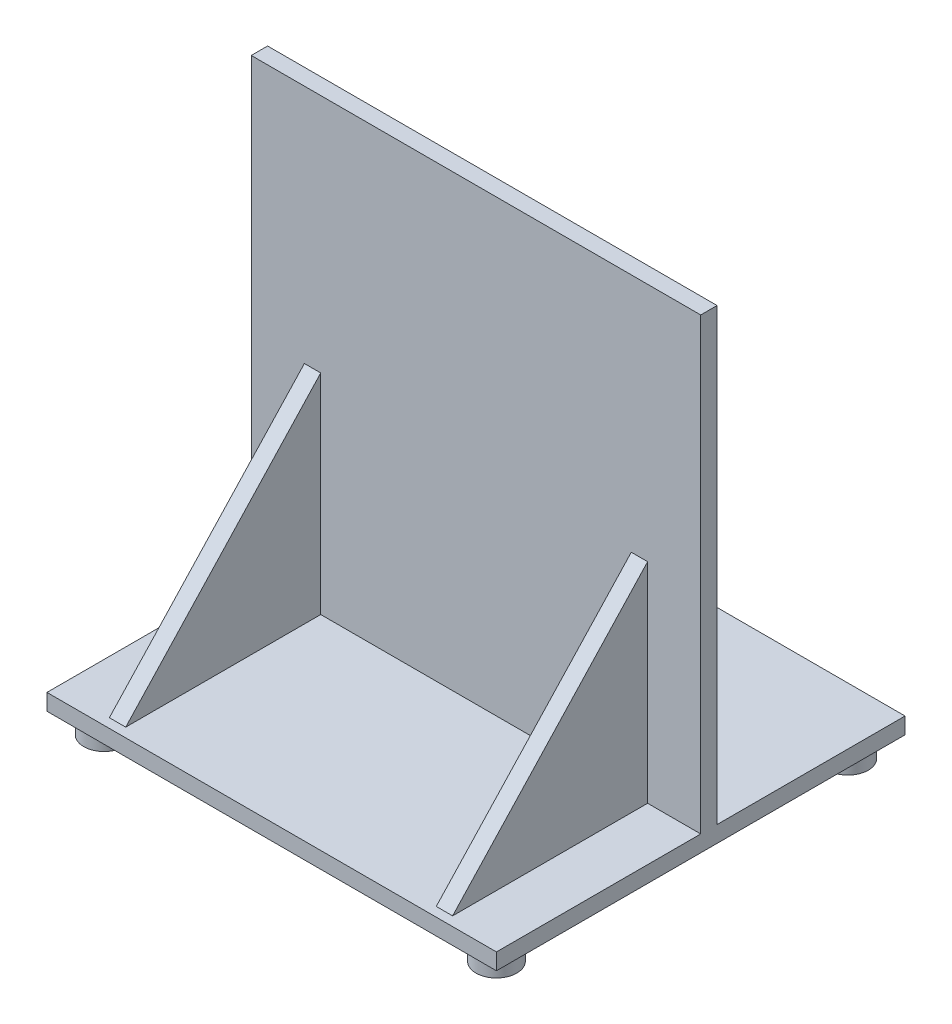
ISO-10303-21;
HEADER;
FILE_DESCRIPTION(('STEP AP214'),'2;1');
FILE_NAME('part.step','',(''),(''),'','','');
FILE_SCHEMA(('AUTOMOTIVE_DESIGN { 1 0 10303 214 1 1 1 1 }'));
ENDSEC;
DATA;
#1=APPLICATION_CONTEXT('core data for automotive mechanical design processes');
#2=APPLICATION_PROTOCOL_DEFINITION('international standard','automotive_design',2000,#1);
#3=PRODUCT_CONTEXT('',#1,'mechanical');
#4=PRODUCT('Part','Part','',(#3));
#5=PRODUCT_RELATED_PRODUCT_CATEGORY('part','',(#4));
#6=PRODUCT_DEFINITION_FORMATION('','',#4);
#7=PRODUCT_DEFINITION_CONTEXT('part definition',#1,'design');
#8=PRODUCT_DEFINITION('design','',#6,#7);
#9=PRODUCT_DEFINITION_SHAPE('','',#8);
#10=(LENGTH_UNIT() NAMED_UNIT(*) SI_UNIT(.MILLI.,.METRE.));
#11=(NAMED_UNIT(*) PLANE_ANGLE_UNIT() SI_UNIT($,.RADIAN.));
#12=(NAMED_UNIT(*) SI_UNIT($,.STERADIAN.) SOLID_ANGLE_UNIT());
#13=UNCERTAINTY_MEASURE_WITH_UNIT(LENGTH_MEASURE(1.E-05),#10,'distance_accuracy_value','');
#14=(GEOMETRIC_REPRESENTATION_CONTEXT(3) GLOBAL_UNCERTAINTY_ASSIGNED_CONTEXT((#13)) GLOBAL_UNIT_ASSIGNED_CONTEXT((#10,
#11,#12)) REPRESENTATION_CONTEXT('',''));
#15=CARTESIAN_POINT('',(0.,0.,0.));
#16=DIRECTION('',(0.,0.,1.));
#17=DIRECTION('',(1.,0.,0.));
#18=AXIS2_PLACEMENT_3D('',#15,#16,#17);
#19=CARTESIAN_POINT('',(0.,82.7884615384615,4.));
#20=DIRECTION('',(1.,0.,0.));
#21=DIRECTION('',(0.,1.,0.));
#22=AXIS2_PLACEMENT_3D('',#19,#20,#21);
#23=PLANE('',#22);
#24=DIRECTION('',(0.,-1.,0.));
#25=VECTOR('',#24,1.);
#26=CARTESIAN_POINT('',(0.,82.7884615384615,0.));
#27=LINE('',#26,#25);
#28=CARTESIAN_POINT('',(0.,82.7884615384615,0.));
#29=VERTEX_POINT('',#28);
#30=CARTESIAN_POINT('',(0.,-27.2115384615385,0.));
#31=VERTEX_POINT('',#30);
#32=EDGE_CURVE('E280',#29,#31,#27,.T.);
#33=ORIENTED_EDGE('',*,*,#32,.T.);
#34=DIRECTION('',(0.,0.,-1.));
#35=VECTOR('',#34,1.);
#36=CARTESIAN_POINT('',(0.,-27.2115384615385,-46.));
#37=LINE('',#36,#35);
#38=CARTESIAN_POINT('',(0.,-27.2115384615385,-46.));
#39=VERTEX_POINT('',#38);
#40=EDGE_CURVE('E240',#31,#39,#37,.T.);
#41=ORIENTED_EDGE('',*,*,#40,.T.);
#42=DIRECTION('',(0.,1.,0.));
#43=VECTOR('',#42,1.);
#44=CARTESIAN_POINT('',(0.,-31.2115384615385,-46.));
#45=LINE('',#44,#43);
#46=CARTESIAN_POINT('',(0.,-31.2115384615385,-46.));
#47=VERTEX_POINT('',#46);
#48=EDGE_CURVE('E277',#47,#39,#45,.T.);
#49=ORIENTED_EDGE('',*,*,#48,.F.);
#50=DIRECTION('',(0.,0.,-1.));
#51=VECTOR('',#50,1.);
#52=CARTESIAN_POINT('',(0.,-31.2115384615385,-46.));
#53=LINE('',#52,#51);
#54=CARTESIAN_POINT('',(0.,-31.2115384615385,54.));
#55=VERTEX_POINT('',#54);
#56=EDGE_CURVE('E248',#55,#47,#53,.T.);
#57=ORIENTED_EDGE('',*,*,#56,.F.);
#58=DIRECTION('',(0.,1.,0.));
#59=VECTOR('',#58,1.);
#60=CARTESIAN_POINT('',(0.,-31.2115384615385,54.));
#61=LINE('',#60,#59);
#62=CARTESIAN_POINT('',(0.,-27.2115384615385,54.));
#63=VERTEX_POINT('',#62);
#64=EDGE_CURVE('E258',#55,#63,#61,.T.);
#65=ORIENTED_EDGE('',*,*,#64,.T.);
#66=CARTESIAN_POINT('',(0.,-27.2115384615385,4.));
#67=VERTEX_POINT('',#66);
#68=EDGE_CURVE('E259',#63,#67,#37,.T.);
#69=ORIENTED_EDGE('',*,*,#68,.T.);
#70=DIRECTION('',(0.,-1.,0.));
#71=VECTOR('',#70,1.);
#72=CARTESIAN_POINT('',(0.,82.7884615384615,4.));
#73=LINE('',#72,#71);
#74=CARTESIAN_POINT('',(0.,82.7884615384615,4.));
#75=VERTEX_POINT('',#74);
#76=EDGE_CURVE('E281',#75,#67,#73,.T.);
#77=ORIENTED_EDGE('',*,*,#76,.F.);
#78=DIRECTION('',(0.,0.,-1.));
#79=VECTOR('',#78,1.);
#80=CARTESIAN_POINT('',(0.,82.7884615384615,4.));
#81=LINE('',#80,#79);
#82=EDGE_CURVE('E293',#75,#29,#81,.T.);
#83=ORIENTED_EDGE('',*,*,#82,.T.);
#84=EDGE_LOOP('',(#33,#41,#49,#57,#65,#69,#77,#83));
#85=FACE_BOUND('',#84,.T.);
#86=ADVANCED_FACE('F35',(#85),#23,.F.);
#87=CARTESIAN_POINT('',(110.,82.7884615384615,4.));
#88=DIRECTION('',(-1.,0.,0.));
#89=DIRECTION('',(0.,-1.,0.));
#90=AXIS2_PLACEMENT_3D('',#87,#88,#89);
#91=PLANE('',#90);
#92=DIRECTION('',(0.,1.,0.));
#93=VECTOR('',#92,1.);
#94=CARTESIAN_POINT('',(110.,82.7884615384615,0.));
#95=LINE('',#94,#93);
#96=CARTESIAN_POINT('',(110.,-27.2115384615385,0.));
#97=VERTEX_POINT('',#96);
#98=CARTESIAN_POINT('',(110.,82.7884615384615,0.));
#99=VERTEX_POINT('',#98);
#100=EDGE_CURVE('E298',#97,#99,#95,.T.);
#101=ORIENTED_EDGE('',*,*,#100,.T.);
#102=DIRECTION('',(0.,0.,-1.));
#103=VECTOR('',#102,1.);
#104=CARTESIAN_POINT('',(110.,82.7884615384615,4.));
#105=LINE('',#104,#103);
#106=CARTESIAN_POINT('',(110.,82.7884615384615,4.));
#107=VERTEX_POINT('',#106);
#108=EDGE_CURVE('E303',#107,#99,#105,.T.);
#109=ORIENTED_EDGE('',*,*,#108,.F.);
#110=DIRECTION('',(0.,1.,0.));
#111=VECTOR('',#110,1.);
#112=CARTESIAN_POINT('',(110.,82.7884615384615,4.));
#113=LINE('',#112,#111);
#114=CARTESIAN_POINT('',(110.,-27.2115384615385,4.));
#115=VERTEX_POINT('',#114);
#116=EDGE_CURVE('E289',#115,#107,#113,.T.);
#117=ORIENTED_EDGE('',*,*,#116,.F.);
#118=DIRECTION('',(0.,0.,1.));
#119=VECTOR('',#118,1.);
#120=CARTESIAN_POINT('',(110.,-27.2115384615385,-46.));
#121=LINE('',#120,#119);
#122=CARTESIAN_POINT('',(110.,-27.2115384615385,54.));
#123=VERTEX_POINT('',#122);
#124=EDGE_CURVE('E264',#115,#123,#121,.T.);
#125=ORIENTED_EDGE('',*,*,#124,.T.);
#126=DIRECTION('',(0.,1.,0.));
#127=VECTOR('',#126,1.);
#128=CARTESIAN_POINT('',(110.,-31.2115384615385,54.));
#129=LINE('',#128,#127);
#130=CARTESIAN_POINT('',(110.,-31.2115384615385,54.));
#131=VERTEX_POINT('',#130);
#132=EDGE_CURVE('E271',#131,#123,#129,.T.);
#133=ORIENTED_EDGE('',*,*,#132,.F.);
#134=DIRECTION('',(0.,0.,1.));
#135=VECTOR('',#134,1.);
#136=CARTESIAN_POINT('',(110.,-31.2115384615385,-46.));
#137=LINE('',#136,#135);
#138=CARTESIAN_POINT('',(110.,-31.2115384615385,-46.));
#139=VERTEX_POINT('',#138);
#140=EDGE_CURVE('E254',#139,#131,#137,.T.);
#141=ORIENTED_EDGE('',*,*,#140,.F.);
#142=DIRECTION('',(0.,1.,0.));
#143=VECTOR('',#142,1.);
#144=CARTESIAN_POINT('',(110.,-31.2115384615385,-46.));
#145=LINE('',#144,#143);
#146=CARTESIAN_POINT('',(110.,-27.2115384615385,-46.));
#147=VERTEX_POINT('',#146);
#148=EDGE_CURVE('E274',#139,#147,#145,.T.);
#149=ORIENTED_EDGE('',*,*,#148,.T.);
#150=EDGE_CURVE('E265',#147,#97,#121,.T.);
#151=ORIENTED_EDGE('',*,*,#150,.T.);
#152=EDGE_LOOP('',(#101,#109,#117,#125,#133,#141,#149,#151));
#153=FACE_BOUND('',#152,.T.);
#154=ADVANCED_FACE('F343',(#153),#91,.F.);
#155=CARTESIAN_POINT('',(0.,82.7884615384615,4.));
#156=DIRECTION('',(0.,-1.,0.));
#157=DIRECTION('',(1.,0.,0.));
#158=AXIS2_PLACEMENT_3D('',#155,#156,#157);
#159=PLANE('',#158);
#160=DIRECTION('',(-1.,0.,0.));
#161=VECTOR('',#160,1.);
#162=CARTESIAN_POINT('',(0.,82.7884615384615,0.));
#163=LINE('',#162,#161);
#164=EDGE_CURVE('E285',#99,#29,#163,.T.);
#165=ORIENTED_EDGE('',*,*,#164,.T.);
#166=ORIENTED_EDGE('',*,*,#82,.F.);
#167=DIRECTION('',(-1.,0.,0.));
#168=VECTOR('',#167,1.);
#169=CARTESIAN_POINT('',(0.,82.7884615384615,4.));
#170=LINE('',#169,#168);
#171=EDGE_CURVE('E291',#107,#75,#170,.T.);
#172=ORIENTED_EDGE('',*,*,#171,.F.);
#173=ORIENTED_EDGE('',*,*,#108,.T.);
#174=EDGE_LOOP('',(#165,#166,#172,#173));
#175=FACE_BOUND('',#174,.T.);
#176=ADVANCED_FACE('F348',(#175),#159,.F.);
#177=CARTESIAN_POINT('',(0.,0.,4.));
#178=DIRECTION('',(0.,0.,1.));
#179=DIRECTION('',(1.,0.,0.));
#180=AXIS2_PLACEMENT_3D('',#177,#178,#179);
#181=PLANE('',#180);
#182=DIRECTION('',(0.,1.,0.));
#183=VECTOR('',#182,1.);
#184=CARTESIAN_POINT('',(97.,0.,4.));
#185=LINE('',#184,#183);
#186=CARTESIAN_POINT('',(97.,-27.2115384615385,4.));
#187=VERTEX_POINT('',#186);
#188=CARTESIAN_POINT('',(97.,23.9961611794516,4.));
#189=VERTEX_POINT('',#188);
#190=EDGE_CURVE('E183',#187,#189,#185,.T.);
#191=ORIENTED_EDGE('',*,*,#190,.F.);
#192=DIRECTION('',(1.,0.,0.));
#193=VECTOR('',#192,1.);
#194=CARTESIAN_POINT('',(0.,-27.2115384615385,4.));
#195=LINE('',#194,#193);
#196=EDGE_CURVE('E284',#187,#115,#195,.T.);
#197=ORIENTED_EDGE('',*,*,#196,.T.);
#198=ORIENTED_EDGE('',*,*,#116,.T.);
#199=ORIENTED_EDGE('',*,*,#171,.T.);
#200=ORIENTED_EDGE('',*,*,#76,.T.);
#201=CARTESIAN_POINT('',(13.,-27.2115384615385,4.));
#202=VERTEX_POINT('',#201);
#203=EDGE_CURVE('E286',#67,#202,#195,.T.);
#204=ORIENTED_EDGE('',*,*,#203,.T.);
#205=DIRECTION('',(0.,1.,0.));
#206=VECTOR('',#205,1.);
#207=CARTESIAN_POINT('',(13.,0.,4.));
#208=LINE('',#207,#206);
#209=CARTESIAN_POINT('',(13.,23.9961611794516,4.00000000000001));
#210=VERTEX_POINT('',#209);
#211=EDGE_CURVE('E57',#202,#210,#208,.T.);
#212=ORIENTED_EDGE('',*,*,#211,.T.);
#213=DIRECTION('',(1.,0.,0.));
#214=VECTOR('',#213,1.);
#215=CARTESIAN_POINT('',(0.,23.9961611794516,4.));
#216=LINE('',#215,#214);
#217=CARTESIAN_POINT('',(17.,23.9961611794516,4.00000000000001));
#218=VERTEX_POINT('',#217);
#219=EDGE_CURVE('E202',#218,#210,#216,.F.);
#220=ORIENTED_EDGE('',*,*,#219,.F.);
#221=DIRECTION('',(0.,1.,0.));
#222=VECTOR('',#221,1.);
#223=CARTESIAN_POINT('',(17.,0.,4.));
#224=LINE('',#223,#222);
#225=CARTESIAN_POINT('',(17.,-27.2115384615385,4.));
#226=VERTEX_POINT('',#225);
#227=EDGE_CURVE('E198',#226,#218,#224,.T.);
#228=ORIENTED_EDGE('',*,*,#227,.F.);
#229=CARTESIAN_POINT('',(93.,-27.2115384615385,4.));
#230=VERTEX_POINT('',#229);
#231=EDGE_CURVE('E180',#226,#230,#195,.T.);
#232=ORIENTED_EDGE('',*,*,#231,.T.);
#233=DIRECTION('',(0.,1.,0.));
#234=VECTOR('',#233,1.);
#235=CARTESIAN_POINT('',(93.,0.,4.));
#236=LINE('',#235,#234);
#237=CARTESIAN_POINT('',(93.,23.9961611794516,4.));
#238=VERTEX_POINT('',#237);
#239=EDGE_CURVE('E49',#230,#238,#236,.T.);
#240=ORIENTED_EDGE('',*,*,#239,.T.);
#241=DIRECTION('',(-1.,0.,0.));
#242=VECTOR('',#241,1.);
#243=CARTESIAN_POINT('',(0.,23.9961611794516,4.));
#244=LINE('',#243,#242);
#245=EDGE_CURVE('E162',#189,#238,#244,.T.);
#246=ORIENTED_EDGE('',*,*,#245,.F.);
#247=EDGE_LOOP('',(#191,#197,#198,#199,#200,#204,#212,#220,#228,#232,#240,#246));
#248=FACE_BOUND('',#247,.T.);
#249=ADVANCED_FACE('F177',(#248),#181,.T.);
#250=CARTESIAN_POINT('',(0.,0.,0.));
#251=DIRECTION('',(0.,0.,1.));
#252=DIRECTION('',(1.,0.,0.));
#253=AXIS2_PLACEMENT_3D('',#250,#251,#252);
#254=PLANE('',#253);
#255=DIRECTION('',(0.,1.,0.));
#256=VECTOR('',#255,1.);
#257=CARTESIAN_POINT('',(4.99999999999999,77.7884615384615,0.));
#258=LINE('',#257,#256);
#259=CARTESIAN_POINT('',(4.99999999999998,-22.2115384615385,0.));
#260=VERTEX_POINT('',#259);
#261=CARTESIAN_POINT('',(4.99999999999999,77.7884615384615,0.));
#262=VERTEX_POINT('',#261);
#263=EDGE_CURVE('E233',#260,#262,#258,.T.);
#264=ORIENTED_EDGE('',*,*,#263,.F.);
#265=DIRECTION('',(-1.,0.,0.));
#266=VECTOR('',#265,1.);
#267=CARTESIAN_POINT('',(105.,-22.2115384615385,0.));
#268=LINE('',#267,#266);
#269=CARTESIAN_POINT('',(105.,-22.2115384615385,0.));
#270=VERTEX_POINT('',#269);
#271=EDGE_CURVE('E231',#270,#260,#268,.T.);
#272=ORIENTED_EDGE('',*,*,#271,.F.);
#273=DIRECTION('',(0.,-1.,0.));
#274=VECTOR('',#273,1.);
#275=CARTESIAN_POINT('',(105.,77.7884615384615,0.));
#276=LINE('',#275,#274);
#277=CARTESIAN_POINT('',(105.,77.7884615384615,0.));
#278=VERTEX_POINT('',#277);
#279=EDGE_CURVE('E216',#278,#270,#276,.T.);
#280=ORIENTED_EDGE('',*,*,#279,.F.);
#281=DIRECTION('',(1.,0.,0.));
#282=VECTOR('',#281,1.);
#283=CARTESIAN_POINT('',(105.,77.7884615384615,0.));
#284=LINE('',#283,#282);
#285=EDGE_CURVE('E221',#262,#278,#284,.T.);
#286=ORIENTED_EDGE('',*,*,#285,.F.);
#287=EDGE_LOOP('',(#264,#272,#280,#286));
#288=FACE_BOUND('',#287,.T.);
#289=ORIENTED_EDGE('',*,*,#100,.F.);
#290=DIRECTION('',(1.,0.,0.));
#291=VECTOR('',#290,1.);
#292=CARTESIAN_POINT('',(0.,-27.2115384615385,0.));
#293=LINE('',#292,#291);
#294=EDGE_CURVE('E296',#31,#97,#293,.T.);
#295=ORIENTED_EDGE('',*,*,#294,.F.);
#296=ORIENTED_EDGE('',*,*,#32,.F.);
#297=ORIENTED_EDGE('',*,*,#164,.F.);
#298=EDGE_LOOP('',(#289,#295,#296,#297));
#299=FACE_BOUND('',#298,.T.);
#300=ADVANCED_FACE('F359',(#288,#299),#254,.F.);
#301=CARTESIAN_POINT('',(0.,-27.2115384615385,0.));
#302=DIRECTION('',(0.,1.,0.));
#303=DIRECTION('',(0.,0.,1.));
#304=AXIS2_PLACEMENT_3D('',#301,#302,#303);
#305=PLANE('',#304);
#306=DIRECTION('',(0.,0.,-1.));
#307=VECTOR('',#306,1.);
#308=CARTESIAN_POINT('',(97.,-27.2115384615385,0.));
#309=LINE('',#308,#307);
#310=CARTESIAN_POINT('',(97.,-27.2115384615385,51.7260044156029));
#311=VERTEX_POINT('',#310);
#312=EDGE_CURVE('E181',#311,#187,#309,.T.);
#313=ORIENTED_EDGE('',*,*,#312,.F.);
#314=DIRECTION('',(1.,0.,0.));
#315=VECTOR('',#314,1.);
#316=CARTESIAN_POINT('',(0.,-27.2115384615385,51.7260044156029));
#317=LINE('',#316,#315);
#318=CARTESIAN_POINT('',(93.,-27.2115384615385,51.7260044156029));
#319=VERTEX_POINT('',#318);
#320=EDGE_CURVE('E171',#319,#311,#317,.T.);
#321=ORIENTED_EDGE('',*,*,#320,.F.);
#322=DIRECTION('',(0.,0.,-1.));
#323=VECTOR('',#322,1.);
#324=CARTESIAN_POINT('',(93.,-27.2115384615385,0.));
#325=LINE('',#324,#323);
#326=EDGE_CURVE('E174',#319,#230,#325,.T.);
#327=ORIENTED_EDGE('',*,*,#326,.T.);
#328=ORIENTED_EDGE('',*,*,#231,.F.);
#329=DIRECTION('',(0.,0.,-1.));
#330=VECTOR('',#329,1.);
#331=CARTESIAN_POINT('',(17.,-27.2115384615385,0.));
#332=LINE('',#331,#330);
#333=CARTESIAN_POINT('',(17.,-27.2115384615385,51.7260044156029));
#334=VERTEX_POINT('',#333);
#335=EDGE_CURVE('E196',#334,#226,#332,.T.);
#336=ORIENTED_EDGE('',*,*,#335,.F.);
#337=DIRECTION('',(-1.,0.,0.));
#338=VECTOR('',#337,1.);
#339=CARTESIAN_POINT('',(0.,-27.2115384615385,51.7260044156029));
#340=LINE('',#339,#338);
#341=CARTESIAN_POINT('',(13.,-27.2115384615385,51.7260044156029));
#342=VERTEX_POINT('',#341);
#343=EDGE_CURVE('E200',#342,#334,#340,.F.);
#344=ORIENTED_EDGE('',*,*,#343,.F.);
#345=DIRECTION('',(0.,0.,-1.));
#346=VECTOR('',#345,1.);
#347=CARTESIAN_POINT('',(13.,-27.2115384615385,0.));
#348=LINE('',#347,#346);
#349=EDGE_CURVE('E192',#342,#202,#348,.T.);
#350=ORIENTED_EDGE('',*,*,#349,.T.);
#351=ORIENTED_EDGE('',*,*,#203,.F.);
#352=ORIENTED_EDGE('',*,*,#68,.F.);
#353=DIRECTION('',(-1.,0.,0.));
#354=VECTOR('',#353,1.);
#355=CARTESIAN_POINT('',(0.,-27.2115384615385,54.));
#356=LINE('',#355,#354);
#357=EDGE_CURVE('E252',#123,#63,#356,.T.);
#358=ORIENTED_EDGE('',*,*,#357,.F.);
#359=ORIENTED_EDGE('',*,*,#124,.F.);
#360=ORIENTED_EDGE('',*,*,#196,.F.);
#361=EDGE_LOOP('',(#313,#321,#327,#328,#336,#344,#350,#351,#352,#358,#359,#360));
#362=FACE_BOUND('',#361,.T.);
#363=ADVANCED_FACE('F378',(#362),#305,.T.);
#364=CARTESIAN_POINT('',(0.,-31.2115384615385,-46.));
#365=DIRECTION('',(0.,0.,1.));
#366=DIRECTION('',(1.,0.,0.));
#367=AXIS2_PLACEMENT_3D('',#364,#365,#366);
#368=PLANE('',#367);
#369=ORIENTED_EDGE('',*,*,#148,.F.);
#370=DIRECTION('',(1.,0.,0.));
#371=VECTOR('',#370,1.);
#372=CARTESIAN_POINT('',(0.,-31.2115384615385,-46.));
#373=LINE('',#372,#371);
#374=EDGE_CURVE('E251',#47,#139,#373,.T.);
#375=ORIENTED_EDGE('',*,*,#374,.F.);
#376=ORIENTED_EDGE('',*,*,#48,.T.);
#377=DIRECTION('',(1.,0.,0.));
#378=VECTOR('',#377,1.);
#379=CARTESIAN_POINT('',(0.,-27.2115384615385,-46.));
#380=LINE('',#379,#378);
#381=EDGE_CURVE('E262',#39,#147,#380,.T.);
#382=ORIENTED_EDGE('',*,*,#381,.T.);
#383=EDGE_LOOP('',(#369,#375,#376,#382));
#384=FACE_BOUND('',#383,.T.);
#385=ADVANCED_FACE('F367',(#384),#368,.F.);
#386=CARTESIAN_POINT('',(0.,-31.2115384615385,54.));
#387=DIRECTION('',(0.,0.,-1.));
#388=DIRECTION('',(-1.,0.,0.));
#389=AXIS2_PLACEMENT_3D('',#386,#387,#388);
#390=PLANE('',#389);
#391=ORIENTED_EDGE('',*,*,#64,.F.);
#392=DIRECTION('',(-1.,0.,0.));
#393=VECTOR('',#392,1.);
#394=CARTESIAN_POINT('',(0.,-31.2115384615385,54.));
#395=LINE('',#394,#393);
#396=EDGE_CURVE('E256',#131,#55,#395,.T.);
#397=ORIENTED_EDGE('',*,*,#396,.F.);
#398=ORIENTED_EDGE('',*,*,#132,.T.);
#399=ORIENTED_EDGE('',*,*,#357,.T.);
#400=EDGE_LOOP('',(#391,#397,#398,#399));
#401=FACE_BOUND('',#400,.T.);
#402=ADVANCED_FACE('F320',(#401),#390,.F.);
#403=CARTESIAN_POINT('',(0.,-31.2115384615385,0.));
#404=DIRECTION('',(0.,1.,0.));
#405=DIRECTION('',(0.,0.,1.));
#406=AXIS2_PLACEMENT_3D('',#403,#404,#405);
#407=PLANE('',#406);
#408=CARTESIAN_POINT('',(103.,-31.2115384615385,-39.));
#409=DIRECTION('',(0.,1.,0.));
#410=DIRECTION('',(0.,0.,1.));
#411=AXIS2_PLACEMENT_3D('',#408,#409,#410);
#412=CIRCLE('',#411,5.00000000000001);
#413=CARTESIAN_POINT('',(103.,-31.2115384615385,-34.));
#414=VERTEX_POINT('',#413);
#415=EDGE_CURVE('E11',#414,#414,#412,.F.);
#416=ORIENTED_EDGE('',*,*,#415,.F.);
#417=EDGE_LOOP('',(#416));
#418=FACE_BOUND('',#417,.T.);
#419=CARTESIAN_POINT('',(103.,-31.2115384615385,47.));
#420=DIRECTION('',(0.,1.,0.));
#421=DIRECTION('',(0.,0.,1.));
#422=AXIS2_PLACEMENT_3D('',#419,#420,#421);
#423=CIRCLE('',#422,5.00000000000001);
#424=CARTESIAN_POINT('',(103.,-31.2115384615385,52.));
#425=VERTEX_POINT('',#424);
#426=EDGE_CURVE('E309',#425,#425,#423,.F.);
#427=ORIENTED_EDGE('',*,*,#426,.F.);
#428=EDGE_LOOP('',(#427));
#429=FACE_BOUND('',#428,.T.);
#430=ORIENTED_EDGE('',*,*,#396,.T.);
#431=ORIENTED_EDGE('',*,*,#56,.T.);
#432=ORIENTED_EDGE('',*,*,#374,.T.);
#433=ORIENTED_EDGE('',*,*,#140,.T.);
#434=EDGE_LOOP('',(#430,#431,#432,#433));
#435=FACE_BOUND('',#434,.T.);
#436=CARTESIAN_POINT('',(7.00000000000001,-31.2115384615385,-39.));
#437=DIRECTION('',(0.,1.,0.));
#438=DIRECTION('',(0.,0.,1.));
#439=AXIS2_PLACEMENT_3D('',#436,#437,#438);
#440=CIRCLE('',#439,5.);
#441=CARTESIAN_POINT('',(7.00000000000001,-31.2115384615385,-34.));
#442=VERTEX_POINT('',#441);
#443=EDGE_CURVE('E42',#442,#442,#440,.F.);
#444=ORIENTED_EDGE('',*,*,#443,.F.);
#445=EDGE_LOOP('',(#444));
#446=FACE_BOUND('',#445,.T.);
#447=CARTESIAN_POINT('',(7.00000000000001,-31.2115384615385,47.));
#448=DIRECTION('',(0.,1.,0.));
#449=DIRECTION('',(0.,0.,1.));
#450=AXIS2_PLACEMENT_3D('',#447,#448,#449);
#451=CIRCLE('',#450,5.);
#452=CARTESIAN_POINT('',(7.00000000000001,-31.2115384615385,52.));
#453=VERTEX_POINT('',#452);
#454=EDGE_CURVE('E306',#453,#453,#451,.F.);
#455=ORIENTED_EDGE('',*,*,#454,.F.);
#456=EDGE_LOOP('',(#455));
#457=FACE_BOUND('',#456,.T.);
#458=ADVANCED_FACE('F316',(#418,#429,#435,#446,#457),#407,.F.);
#459=ORIENTED_EDGE('',*,*,#150,.F.);
#460=ORIENTED_EDGE('',*,*,#381,.F.);
#461=ORIENTED_EDGE('',*,*,#40,.F.);
#462=ORIENTED_EDGE('',*,*,#294,.T.);
#463=EDGE_LOOP('',(#459,#460,#461,#462));
#464=FACE_BOUND('',#463,.T.);
#465=ADVANCED_FACE('F319',(#464),#305,.T.);
#466=CARTESIAN_POINT('',(105.,77.7884615384615,1.));
#467=DIRECTION('',(1.,0.,0.));
#468=DIRECTION('',(0.,1.,0.));
#469=AXIS2_PLACEMENT_3D('',#466,#467,#468);
#470=PLANE('',#469);
#471=ORIENTED_EDGE('',*,*,#279,.T.);
#472=DIRECTION('',(0.,0.,-1.));
#473=VECTOR('',#472,1.);
#474=CARTESIAN_POINT('',(105.,-22.2115384615385,1.));
#475=LINE('',#474,#473);
#476=CARTESIAN_POINT('',(105.,-22.2115384615385,1.));
#477=VERTEX_POINT('',#476);
#478=EDGE_CURVE('E229',#477,#270,#475,.T.);
#479=ORIENTED_EDGE('',*,*,#478,.F.);
#480=DIRECTION('',(0.,-1.,0.));
#481=VECTOR('',#480,1.);
#482=CARTESIAN_POINT('',(105.,77.7884615384615,1.));
#483=LINE('',#482,#481);
#484=CARTESIAN_POINT('',(105.,77.7884615384615,1.));
#485=VERTEX_POINT('',#484);
#486=EDGE_CURVE('E217',#485,#477,#483,.T.);
#487=ORIENTED_EDGE('',*,*,#486,.F.);
#488=DIRECTION('',(0.,0.,-1.));
#489=VECTOR('',#488,1.);
#490=CARTESIAN_POINT('',(105.,77.7884615384615,1.));
#491=LINE('',#490,#489);
#492=EDGE_CURVE('E238',#485,#278,#491,.T.);
#493=ORIENTED_EDGE('',*,*,#492,.T.);
#494=EDGE_LOOP('',(#471,#479,#487,#493));
#495=FACE_BOUND('',#494,.T.);
#496=ADVANCED_FACE('F398',(#495),#470,.F.);
#497=CARTESIAN_POINT('',(105.,77.7884615384615,1.));
#498=DIRECTION('',(0.,1.,0.));
#499=DIRECTION('',(0.,0.,1.));
#500=AXIS2_PLACEMENT_3D('',#497,#498,#499);
#501=PLANE('',#500);
#502=ORIENTED_EDGE('',*,*,#285,.T.);
#503=ORIENTED_EDGE('',*,*,#492,.F.);
#504=DIRECTION('',(1.,0.,0.));
#505=VECTOR('',#504,1.);
#506=CARTESIAN_POINT('',(105.,77.7884615384615,1.));
#507=LINE('',#506,#505);
#508=CARTESIAN_POINT('',(4.99999999999999,77.7884615384615,1.));
#509=VERTEX_POINT('',#508);
#510=EDGE_CURVE('E226',#509,#485,#507,.T.);
#511=ORIENTED_EDGE('',*,*,#510,.F.);
#512=DIRECTION('',(0.,0.,-1.));
#513=VECTOR('',#512,1.);
#514=CARTESIAN_POINT('',(4.99999999999999,77.7884615384615,1.));
#515=LINE('',#514,#513);
#516=EDGE_CURVE('E241',#509,#262,#515,.T.);
#517=ORIENTED_EDGE('',*,*,#516,.T.);
#518=EDGE_LOOP('',(#502,#503,#511,#517));
#519=FACE_BOUND('',#518,.T.);
#520=ADVANCED_FACE('F402',(#519),#501,.F.);
#521=CARTESIAN_POINT('',(4.99999999999999,77.7884615384615,1.));
#522=DIRECTION('',(-1.,0.,0.));
#523=DIRECTION('',(0.,-1.,0.));
#524=AXIS2_PLACEMENT_3D('',#521,#522,#523);
#525=PLANE('',#524);
#526=ORIENTED_EDGE('',*,*,#263,.T.);
#527=ORIENTED_EDGE('',*,*,#516,.F.);
#528=DIRECTION('',(0.,1.,0.));
#529=VECTOR('',#528,1.);
#530=CARTESIAN_POINT('',(4.99999999999999,77.7884615384615,1.));
#531=LINE('',#530,#529);
#532=CARTESIAN_POINT('',(4.99999999999998,-22.2115384615385,1.));
#533=VERTEX_POINT('',#532);
#534=EDGE_CURVE('E223',#533,#509,#531,.T.);
#535=ORIENTED_EDGE('',*,*,#534,.F.);
#536=DIRECTION('',(0.,0.,-1.));
#537=VECTOR('',#536,1.);
#538=CARTESIAN_POINT('',(4.99999999999998,-22.2115384615385,1.));
#539=LINE('',#538,#537);
#540=EDGE_CURVE('E243',#533,#260,#539,.T.);
#541=ORIENTED_EDGE('',*,*,#540,.T.);
#542=EDGE_LOOP('',(#526,#527,#535,#541));
#543=FACE_BOUND('',#542,.T.);
#544=ADVANCED_FACE('F406',(#543),#525,.F.);
#545=CARTESIAN_POINT('',(105.,-22.2115384615385,1.));
#546=DIRECTION('',(0.,-1.,0.));
#547=DIRECTION('',(0.,0.,-1.));
#548=AXIS2_PLACEMENT_3D('',#545,#546,#547);
#549=PLANE('',#548);
#550=ORIENTED_EDGE('',*,*,#271,.T.);
#551=ORIENTED_EDGE('',*,*,#540,.F.);
#552=DIRECTION('',(-1.,0.,0.));
#553=VECTOR('',#552,1.);
#554=CARTESIAN_POINT('',(105.,-22.2115384615385,1.));
#555=LINE('',#554,#553);
#556=EDGE_CURVE('E220',#477,#533,#555,.T.);
#557=ORIENTED_EDGE('',*,*,#556,.F.);
#558=ORIENTED_EDGE('',*,*,#478,.T.);
#559=EDGE_LOOP('',(#550,#551,#557,#558));
#560=FACE_BOUND('',#559,.T.);
#561=ADVANCED_FACE('F338',(#560),#549,.F.);
#562=CARTESIAN_POINT('',(0.,0.,1.));
#563=DIRECTION('',(0.,0.,-1.));
#564=DIRECTION('',(-1.,0.,0.));
#565=AXIS2_PLACEMENT_3D('',#562,#563,#564);
#566=PLANE('',#565);
#567=ORIENTED_EDGE('',*,*,#556,.T.);
#568=ORIENTED_EDGE('',*,*,#534,.T.);
#569=ORIENTED_EDGE('',*,*,#510,.T.);
#570=ORIENTED_EDGE('',*,*,#486,.T.);
#571=EDGE_LOOP('',(#567,#568,#569,#570));
#572=FACE_BOUND('',#571,.T.);
#573=ADVANCED_FACE('F328',(#572),#566,.T.);
#574=CARTESIAN_POINT('',(7.00000000000001,-36.2115384615385,47.));
#575=DIRECTION('',(0.,1.,0.));
#576=DIRECTION('',(0.,0.,1.));
#577=AXIS2_PLACEMENT_3D('',#574,#575,#576);
#578=CYLINDRICAL_SURFACE('',#577,5.);
#579=CARTESIAN_POINT('',(7.00000000000001,-36.2115384615385,47.));
#580=DIRECTION('',(0.,-1.,0.));
#581=DIRECTION('',(0.,0.,-1.));
#582=AXIS2_PLACEMENT_3D('',#579,#580,#581);
#583=CIRCLE('',#582,5.);
#584=CARTESIAN_POINT('',(7.00000000000001,-36.2115384615385,42.));
#585=VERTEX_POINT('',#584);
#586=EDGE_CURVE('E213',#585,#585,#583,.T.);
#587=ORIENTED_EDGE('',*,*,#586,.F.);
#588=EDGE_LOOP('',(#587));
#589=FACE_BOUND('',#588,.T.);
#590=ORIENTED_EDGE('',*,*,#454,.T.);
#591=EDGE_LOOP('',(#590));
#592=FACE_BOUND('',#591,.T.);
#593=ADVANCED_FACE('F325',(#589,#592),#578,.T.);
#594=CARTESIAN_POINT('',(7.00000000000001,-36.2115384615385,47.));
#595=DIRECTION('',(0.,-1.,0.));
#596=DIRECTION('',(0.,0.,-1.));
#597=AXIS2_PLACEMENT_3D('',#594,#595,#596);
#598=PLANE('',#597);
#599=ORIENTED_EDGE('',*,*,#586,.T.);
#600=EDGE_LOOP('',(#599));
#601=FACE_BOUND('',#600,.T.);
#602=ADVANCED_FACE('F327',(#601),#598,.T.);
#603=CARTESIAN_POINT('',(103.,-36.2115384615385,47.));
#604=DIRECTION('',(0.,1.,0.));
#605=DIRECTION('',(0.,0.,1.));
#606=AXIS2_PLACEMENT_3D('',#603,#604,#605);
#607=CYLINDRICAL_SURFACE('',#606,5.00000000000001);
#608=CARTESIAN_POINT('',(103.,-36.2115384615385,47.));
#609=DIRECTION('',(0.,-1.,0.));
#610=DIRECTION('',(0.,0.,-1.));
#611=AXIS2_PLACEMENT_3D('',#608,#609,#610);
#612=CIRCLE('',#611,5.00000000000001);
#613=CARTESIAN_POINT('',(103.,-36.2115384615385,42.));
#614=VERTEX_POINT('',#613);
#615=EDGE_CURVE('E210',#614,#614,#612,.T.);
#616=ORIENTED_EDGE('',*,*,#615,.F.);
#617=EDGE_LOOP('',(#616));
#618=FACE_BOUND('',#617,.T.);
#619=ORIENTED_EDGE('',*,*,#426,.T.);
#620=EDGE_LOOP('',(#619));
#621=FACE_BOUND('',#620,.T.);
#622=ADVANCED_FACE('F335',(#618,#621),#607,.T.);
#623=CARTESIAN_POINT('',(103.,-36.2115384615385,47.));
#624=DIRECTION('',(0.,-1.,0.));
#625=DIRECTION('',(0.,0.,-1.));
#626=AXIS2_PLACEMENT_3D('',#623,#624,#625);
#627=PLANE('',#626);
#628=ORIENTED_EDGE('',*,*,#615,.T.);
#629=EDGE_LOOP('',(#628));
#630=FACE_BOUND('',#629,.T.);
#631=ADVANCED_FACE('F497',(#630),#627,.T.);
#632=CARTESIAN_POINT('',(7.00000000000001,-36.2115384615385,-39.));
#633=DIRECTION('',(0.,1.,0.));
#634=DIRECTION('',(0.,0.,1.));
#635=AXIS2_PLACEMENT_3D('',#632,#633,#634);
#636=CYLINDRICAL_SURFACE('',#635,5.);
#637=CARTESIAN_POINT('',(7.00000000000001,-36.2115384615385,-39.));
#638=DIRECTION('',(0.,-1.,0.));
#639=DIRECTION('',(0.,0.,-1.));
#640=AXIS2_PLACEMENT_3D('',#637,#638,#639);
#641=CIRCLE('',#640,5.);
#642=CARTESIAN_POINT('',(7.00000000000001,-36.2115384615385,-44.));
#643=VERTEX_POINT('',#642);
#644=EDGE_CURVE('E207',#643,#643,#641,.T.);
#645=ORIENTED_EDGE('',*,*,#644,.F.);
#646=EDGE_LOOP('',(#645));
#647=FACE_BOUND('',#646,.T.);
#648=ORIENTED_EDGE('',*,*,#443,.T.);
#649=EDGE_LOOP('',(#648));
#650=FACE_BOUND('',#649,.T.);
#651=ADVANCED_FACE('F314',(#647,#650),#636,.T.);
#652=CARTESIAN_POINT('',(7.00000000000001,-36.2115384615385,-39.));
#653=DIRECTION('',(0.,-1.,0.));
#654=DIRECTION('',(0.,0.,-1.));
#655=AXIS2_PLACEMENT_3D('',#652,#653,#654);
#656=PLANE('',#655);
#657=ORIENTED_EDGE('',*,*,#644,.T.);
#658=EDGE_LOOP('',(#657));
#659=FACE_BOUND('',#658,.T.);
#660=ADVANCED_FACE('F490',(#659),#656,.T.);
#661=CARTESIAN_POINT('',(103.,-36.2115384615385,-39.));
#662=DIRECTION('',(0.,1.,0.));
#663=DIRECTION('',(0.,0.,1.));
#664=AXIS2_PLACEMENT_3D('',#661,#662,#663);
#665=CYLINDRICAL_SURFACE('',#664,5.00000000000001);
#666=CARTESIAN_POINT('',(103.,-36.2115384615385,-39.));
#667=DIRECTION('',(0.,-1.,0.));
#668=DIRECTION('',(0.,0.,-1.));
#669=AXIS2_PLACEMENT_3D('',#666,#667,#668);
#670=CIRCLE('',#669,5.00000000000001);
#671=CARTESIAN_POINT('',(103.,-36.2115384615385,-44.));
#672=VERTEX_POINT('',#671);
#673=EDGE_CURVE('E204',#672,#672,#670,.T.);
#674=ORIENTED_EDGE('',*,*,#673,.F.);
#675=EDGE_LOOP('',(#674));
#676=FACE_BOUND('',#675,.T.);
#677=ORIENTED_EDGE('',*,*,#415,.T.);
#678=EDGE_LOOP('',(#677));
#679=FACE_BOUND('',#678,.T.);
#680=ADVANCED_FACE('F486',(#676,#679),#665,.T.);
#681=CARTESIAN_POINT('',(103.,-36.2115384615385,-39.));
#682=DIRECTION('',(0.,-1.,0.));
#683=DIRECTION('',(0.,0.,-1.));
#684=AXIS2_PLACEMENT_3D('',#681,#682,#683);
#685=PLANE('',#684);
#686=ORIENTED_EDGE('',*,*,#673,.T.);
#687=EDGE_LOOP('',(#686));
#688=FACE_BOUND('',#687,.T.);
#689=ADVANCED_FACE('F482',(#688),#685,.T.);
#690=CARTESIAN_POINT('',(15.,-27.2115384615385,51.7260044156029));
#691=DIRECTION('',(0.,-0.681800063080041,-0.731538566299858));
#692=DIRECTION('',(0.,0.731538566299858,-0.681800063080041));
#693=AXIS2_PLACEMENT_3D('',#690,#691,#692);
#694=PLANE('',#693);
#695=DIRECTION('',(0.,0.731538566299858,-0.681800063080041));
#696=VECTOR('',#695,1.);
#697=CARTESIAN_POINT('',(17.,-27.2115384615385,51.7260044156029));
#698=LINE('',#697,#696);
#699=EDGE_CURVE('E189',#334,#218,#698,.T.);
#700=ORIENTED_EDGE('',*,*,#699,.T.);
#701=ORIENTED_EDGE('',*,*,#219,.T.);
#702=DIRECTION('',(0.,0.731538566299858,-0.681800063080041));
#703=VECTOR('',#702,1.);
#704=CARTESIAN_POINT('',(13.,-27.2115384615385,51.7260044156029));
#705=LINE('',#704,#703);
#706=EDGE_CURVE('E170',#342,#210,#705,.T.);
#707=ORIENTED_EDGE('',*,*,#706,.F.);
#708=ORIENTED_EDGE('',*,*,#343,.T.);
#709=EDGE_LOOP('',(#700,#701,#707,#708));
#710=FACE_BOUND('',#709,.T.);
#711=ADVANCED_FACE('F477',(#710),#694,.F.);
#712=CARTESIAN_POINT('',(17.,23.2884615384615,4.));
#713=DIRECTION('',(1.,0.,0.));
#714=DIRECTION('',(0.,0.,-1.));
#715=AXIS2_PLACEMENT_3D('',#712,#713,#714);
#716=PLANE('',#715);
#717=ORIENTED_EDGE('',*,*,#335,.T.);
#718=ORIENTED_EDGE('',*,*,#227,.T.);
#719=ORIENTED_EDGE('',*,*,#699,.F.);
#720=EDGE_LOOP('',(#717,#718,#719));
#721=FACE_BOUND('',#720,.T.);
#722=ADVANCED_FACE('F474',(#721),#716,.T.);
#723=CARTESIAN_POINT('',(13.,23.2884615384615,4.));
#724=DIRECTION('',(1.,0.,0.));
#725=DIRECTION('',(0.,0.,-1.));
#726=AXIS2_PLACEMENT_3D('',#723,#724,#725);
#727=PLANE('',#726);
#728=ORIENTED_EDGE('',*,*,#211,.F.);
#729=ORIENTED_EDGE('',*,*,#349,.F.);
#730=ORIENTED_EDGE('',*,*,#706,.T.);
#731=EDGE_LOOP('',(#728,#729,#730));
#732=FACE_BOUND('',#731,.T.);
#733=ADVANCED_FACE('F450',(#732),#727,.F.);
#734=CARTESIAN_POINT('',(95.,23.9961611794516,4.));
#735=DIRECTION('',(0.,0.681800063080041,0.731538566299858));
#736=DIRECTION('',(0.,-0.731538566299858,0.681800063080041));
#737=AXIS2_PLACEMENT_3D('',#734,#735,#736);
#738=PLANE('',#737);
#739=DIRECTION('',(0.,-0.731538566299858,0.681800063080041));
#740=VECTOR('',#739,1.);
#741=CARTESIAN_POINT('',(97.,23.9961611794516,4.));
#742=LINE('',#741,#740);
#743=EDGE_CURVE('E167',#189,#311,#742,.T.);
#744=ORIENTED_EDGE('',*,*,#743,.F.);
#745=ORIENTED_EDGE('',*,*,#245,.T.);
#746=DIRECTION('',(0.,-0.731538566299858,0.681800063080041));
#747=VECTOR('',#746,1.);
#748=CARTESIAN_POINT('',(93.,23.9961611794516,4.));
#749=LINE('',#748,#747);
#750=EDGE_CURVE('E164',#238,#319,#749,.T.);
#751=ORIENTED_EDGE('',*,*,#750,.T.);
#752=ORIENTED_EDGE('',*,*,#320,.T.);
#753=EDGE_LOOP('',(#744,#745,#751,#752));
#754=FACE_BOUND('',#753,.T.);
#755=ADVANCED_FACE('F163',(#754),#738,.T.);
#756=CARTESIAN_POINT('',(97.,23.2884615384615,4.));
#757=DIRECTION('',(1.,0.,0.));
#758=DIRECTION('',(0.,0.,-1.));
#759=AXIS2_PLACEMENT_3D('',#756,#757,#758);
#760=PLANE('',#759);
#761=ORIENTED_EDGE('',*,*,#312,.T.);
#762=ORIENTED_EDGE('',*,*,#190,.T.);
#763=ORIENTED_EDGE('',*,*,#743,.T.);
#764=EDGE_LOOP('',(#761,#762,#763));
#765=FACE_BOUND('',#764,.T.);
#766=ADVANCED_FACE('F449',(#765),#760,.T.);
#767=CARTESIAN_POINT('',(93.,23.2884615384615,4.));
#768=DIRECTION('',(1.,0.,0.));
#769=DIRECTION('',(0.,0.,-1.));
#770=AXIS2_PLACEMENT_3D('',#767,#768,#769);
#771=PLANE('',#770);
#772=ORIENTED_EDGE('',*,*,#239,.F.);
#773=ORIENTED_EDGE('',*,*,#326,.F.);
#774=ORIENTED_EDGE('',*,*,#750,.F.);
#775=EDGE_LOOP('',(#772,#773,#774));
#776=FACE_BOUND('',#775,.T.);
#777=ADVANCED_FACE('F173',(#776),#771,.F.);
#778=CLOSED_SHELL('',(#86,#154,#176,#249,#300,#363,#385,#402,#458,#465,#496,#520,#544,#561,#573,
#593,#602,#622,#631,#651,#660,#680,#689,#711,#722,#733,#755,#766,#777));
#779=MANIFOLD_SOLID_BREP('B2',#778);
#780=ADVANCED_BREP_SHAPE_REPRESENTATION('',(#18,#779),#14);
#781=SHAPE_DEFINITION_REPRESENTATION(#9,#780);
ENDSEC;
END-ISO-10303-21;
